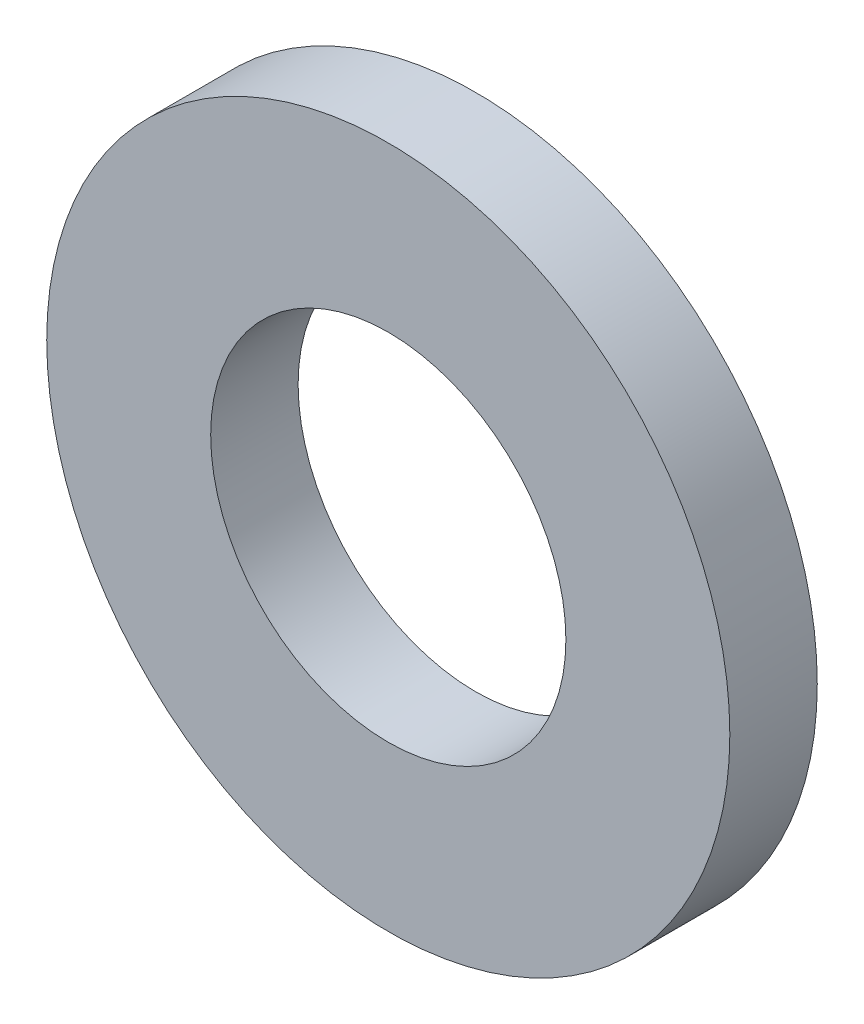
ISO-10303-21;
HEADER;
FILE_DESCRIPTION(('STEP AP214'),'2;1');
FILE_NAME('part.step','',(''),(''),'','','');
FILE_SCHEMA(('AUTOMOTIVE_DESIGN { 1 0 10303 214 1 1 1 1 }'));
ENDSEC;
DATA;
#1=APPLICATION_CONTEXT('core data for automotive mechanical design processes');
#2=APPLICATION_PROTOCOL_DEFINITION('international standard','automotive_design',2000,#1);
#3=PRODUCT_CONTEXT('',#1,'mechanical');
#4=PRODUCT('Part','Part','',(#3));
#5=PRODUCT_RELATED_PRODUCT_CATEGORY('part','',(#4));
#6=PRODUCT_DEFINITION_FORMATION('','',#4);
#7=PRODUCT_DEFINITION_CONTEXT('part definition',#1,'design');
#8=PRODUCT_DEFINITION('design','',#6,#7);
#9=PRODUCT_DEFINITION_SHAPE('','',#8);
#10=(LENGTH_UNIT() NAMED_UNIT(*) SI_UNIT(.MILLI.,.METRE.));
#11=(NAMED_UNIT(*) PLANE_ANGLE_UNIT() SI_UNIT($,.RADIAN.));
#12=(NAMED_UNIT(*) SI_UNIT($,.STERADIAN.) SOLID_ANGLE_UNIT());
#13=UNCERTAINTY_MEASURE_WITH_UNIT(LENGTH_MEASURE(1.E-05),#10,'distance_accuracy_value','');
#14=(GEOMETRIC_REPRESENTATION_CONTEXT(3) GLOBAL_UNCERTAINTY_ASSIGNED_CONTEXT((#13)) GLOBAL_UNIT_ASSIGNED_CONTEXT((#10,
#11,#12)) REPRESENTATION_CONTEXT('',''));
#15=CARTESIAN_POINT('',(0.,0.,0.));
#16=DIRECTION('',(0.,0.,1.));
#17=DIRECTION('',(1.,0.,0.));
#18=AXIS2_PLACEMENT_3D('',#15,#16,#17);
#19=CARTESIAN_POINT('',(0.,0.,1.6));
#20=DIRECTION('',(0.,0.,1.));
#21=DIRECTION('',(1.,0.,0.));
#22=AXIS2_PLACEMENT_3D('',#19,#20,#21);
#23=PLANE('',#22);
#24=CARTESIAN_POINT('',(0.,0.,1.6));
#25=DIRECTION('',(0.,0.,1.));
#26=DIRECTION('',(1.,0.,0.));
#27=AXIS2_PLACEMENT_3D('',#24,#25,#26);
#28=CIRCLE('',#27,6.25);
#29=CARTESIAN_POINT('',(6.25,0.,1.6));
#30=VERTEX_POINT('',#29);
#31=EDGE_CURVE('E10',#30,#30,#28,.T.);
#32=ORIENTED_EDGE('',*,*,#31,.T.);
#33=EDGE_LOOP('',(#32));
#34=FACE_BOUND('',#33,.T.);
#35=CARTESIAN_POINT('',(0.,0.,1.6));
#36=DIRECTION('',(0.,0.,1.));
#37=DIRECTION('',(1.,0.,0.));
#38=AXIS2_PLACEMENT_3D('',#35,#36,#37);
#39=CIRCLE('',#38,3.25);
#40=CARTESIAN_POINT('',(3.25,0.,1.6));
#41=VERTEX_POINT('',#40);
#42=EDGE_CURVE('E50',#41,#41,#39,.T.);
#43=ORIENTED_EDGE('',*,*,#42,.F.);
#44=EDGE_LOOP('',(#43));
#45=FACE_BOUND('',#44,.T.);
#46=ADVANCED_FACE('F37',(#34,#45),#23,.T.);
#47=CARTESIAN_POINT('',(0.,0.,0.));
#48=DIRECTION('',(0.,0.,1.));
#49=DIRECTION('',(1.,0.,0.));
#50=AXIS2_PLACEMENT_3D('',#47,#48,#49);
#51=PLANE('',#50);
#52=CARTESIAN_POINT('',(0.,0.,0.));
#53=DIRECTION('',(0.,0.,1.));
#54=DIRECTION('',(1.,0.,0.));
#55=AXIS2_PLACEMENT_3D('',#52,#53,#54);
#56=CIRCLE('',#55,6.25);
#57=CARTESIAN_POINT('',(6.25,0.,0.));
#58=VERTEX_POINT('',#57);
#59=EDGE_CURVE('E41',#58,#58,#56,.T.);
#60=ORIENTED_EDGE('',*,*,#59,.F.);
#61=EDGE_LOOP('',(#60));
#62=FACE_BOUND('',#61,.T.);
#63=CARTESIAN_POINT('',(0.,0.,0.));
#64=DIRECTION('',(0.,0.,1.));
#65=DIRECTION('',(1.,0.,0.));
#66=AXIS2_PLACEMENT_3D('',#63,#64,#65);
#67=CIRCLE('',#66,3.25);
#68=CARTESIAN_POINT('',(3.25,0.,0.));
#69=VERTEX_POINT('',#68);
#70=EDGE_CURVE('E52',#69,#69,#67,.T.);
#71=ORIENTED_EDGE('',*,*,#70,.T.);
#72=EDGE_LOOP('',(#71));
#73=FACE_BOUND('',#72,.T.);
#74=ADVANCED_FACE('F64',(#62,#73),#51,.F.);
#75=CARTESIAN_POINT('',(0.,0.,1.6));
#76=DIRECTION('',(0.,0.,-1.));
#77=DIRECTION('',(-1.,0.,0.));
#78=AXIS2_PLACEMENT_3D('',#75,#76,#77);
#79=CYLINDRICAL_SURFACE('',#78,6.25);
#80=ORIENTED_EDGE('',*,*,#31,.F.);
#81=EDGE_LOOP('',(#80));
#82=FACE_BOUND('',#81,.T.);
#83=ORIENTED_EDGE('',*,*,#59,.T.);
#84=EDGE_LOOP('',(#83));
#85=FACE_BOUND('',#84,.T.);
#86=ADVANCED_FACE('F39',(#82,#85),#79,.T.);
#87=CARTESIAN_POINT('',(0.,0.,1.6));
#88=DIRECTION('',(0.,0.,-1.));
#89=DIRECTION('',(-1.,0.,0.));
#90=AXIS2_PLACEMENT_3D('',#87,#88,#89);
#91=CYLINDRICAL_SURFACE('',#90,3.25);
#92=ORIENTED_EDGE('',*,*,#42,.T.);
#93=EDGE_LOOP('',(#92));
#94=FACE_BOUND('',#93,.T.);
#95=ORIENTED_EDGE('',*,*,#70,.F.);
#96=EDGE_LOOP('',(#95));
#97=FACE_BOUND('',#96,.T.);
#98=ADVANCED_FACE('F60',(#94,#97),#91,.F.);
#99=CLOSED_SHELL('',(#46,#74,#86,#98));
#100=MANIFOLD_SOLID_BREP('B2',#99);
#101=ADVANCED_BREP_SHAPE_REPRESENTATION('',(#18,#100),#14);
#102=SHAPE_DEFINITION_REPRESENTATION(#9,#101);
ENDSEC;
END-ISO-10303-21;
